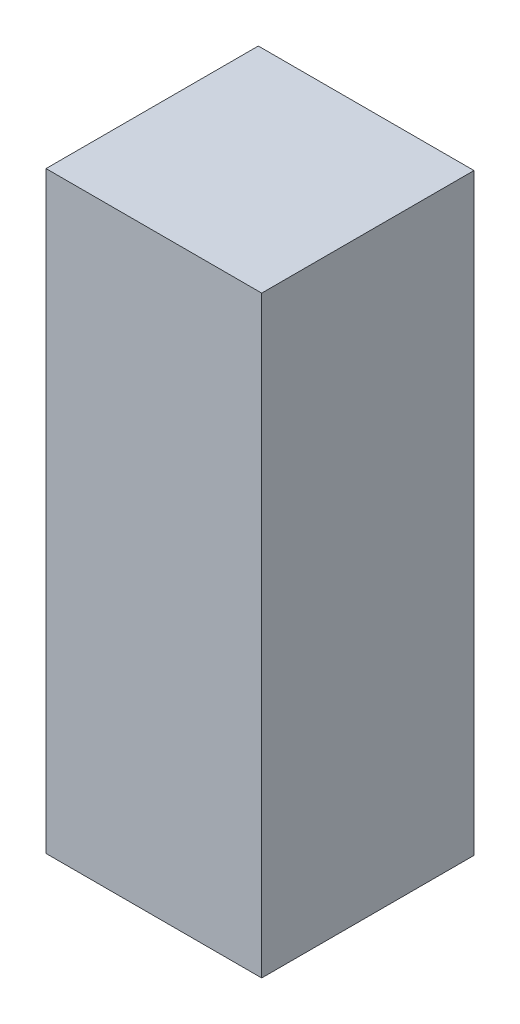
ISO-10303-21;
HEADER;
FILE_DESCRIPTION(('STEP AP214'),'2;1');
FILE_NAME('part.step','',(''),(''),'','','');
FILE_SCHEMA(('AUTOMOTIVE_DESIGN { 1 0 10303 214 1 1 1 1 }'));
ENDSEC;
DATA;
#1=APPLICATION_CONTEXT('core data for automotive mechanical design processes');
#2=APPLICATION_PROTOCOL_DEFINITION('international standard','automotive_design',2000,#1);
#3=PRODUCT_CONTEXT('',#1,'mechanical');
#4=PRODUCT('Part','Part','',(#3));
#5=PRODUCT_RELATED_PRODUCT_CATEGORY('part','',(#4));
#6=PRODUCT_DEFINITION_FORMATION('','',#4);
#7=PRODUCT_DEFINITION_CONTEXT('part definition',#1,'design');
#8=PRODUCT_DEFINITION('design','',#6,#7);
#9=PRODUCT_DEFINITION_SHAPE('','',#8);
#10=(LENGTH_UNIT() NAMED_UNIT(*) SI_UNIT(.MILLI.,.METRE.));
#11=(NAMED_UNIT(*) PLANE_ANGLE_UNIT() SI_UNIT($,.RADIAN.));
#12=(NAMED_UNIT(*) SI_UNIT($,.STERADIAN.) SOLID_ANGLE_UNIT());
#13=UNCERTAINTY_MEASURE_WITH_UNIT(LENGTH_MEASURE(1.E-05),#10,'distance_accuracy_value','');
#14=(GEOMETRIC_REPRESENTATION_CONTEXT(3) GLOBAL_UNCERTAINTY_ASSIGNED_CONTEXT((#13)) GLOBAL_UNIT_ASSIGNED_CONTEXT((#10,
#11,#12)) REPRESENTATION_CONTEXT('',''));
#15=CARTESIAN_POINT('',(0.,0.,0.));
#16=DIRECTION('',(0.,0.,1.));
#17=DIRECTION('',(1.,0.,0.));
#18=AXIS2_PLACEMENT_3D('',#15,#16,#17);
#19=CARTESIAN_POINT('',(0.,0.,0.1999996));
#20=DIRECTION('',(0.,0.,1.));
#21=DIRECTION('',(1.,0.,0.));
#22=AXIS2_PLACEMENT_3D('',#19,#20,#21);
#23=PLANE('',#22);
#24=DIRECTION('',(0.,1.,0.));
#25=VECTOR('',#24,1.);
#26=CARTESIAN_POINT('',(0.1016,-0.2794,0.1999996));
#27=LINE('',#26,#25);
#28=CARTESIAN_POINT('',(0.1016,-0.2794,0.1999996));
#29=VERTEX_POINT('',#28);
#30=CARTESIAN_POINT('',(0.1016,0.2794,0.1999996));
#31=VERTEX_POINT('',#30);
#32=EDGE_CURVE('E70',#29,#31,#27,.T.);
#33=ORIENTED_EDGE('',*,*,#32,.T.);
#34=DIRECTION('',(-1.,0.,0.));
#35=VECTOR('',#34,1.);
#36=CARTESIAN_POINT('',(0.1016,0.2794,0.1999996));
#37=LINE('',#36,#35);
#38=CARTESIAN_POINT('',(-0.1016,0.2794,0.1999996));
#39=VERTEX_POINT('',#38);
#40=EDGE_CURVE('E100',#31,#39,#37,.T.);
#41=ORIENTED_EDGE('',*,*,#40,.T.);
#42=DIRECTION('',(0.,-1.,0.));
#43=VECTOR('',#42,1.);
#44=CARTESIAN_POINT('',(-0.1016,0.2794,0.1999996));
#45=LINE('',#44,#43);
#46=CARTESIAN_POINT('',(-0.1016,-0.2794,0.1999996));
#47=VERTEX_POINT('',#46);
#48=EDGE_CURVE('E72',#39,#47,#45,.T.);
#49=ORIENTED_EDGE('',*,*,#48,.T.);
#50=DIRECTION('',(1.,0.,0.));
#51=VECTOR('',#50,1.);
#52=CARTESIAN_POINT('',(-0.1016,-0.2794,0.1999996));
#53=LINE('',#52,#51);
#54=EDGE_CURVE('E11',#47,#29,#53,.T.);
#55=ORIENTED_EDGE('',*,*,#54,.T.);
#56=EDGE_LOOP('',(#33,#41,#49,#55));
#57=FACE_BOUND('',#56,.T.);
#58=ADVANCED_FACE('F17',(#57),#23,.T.);
#59=CARTESIAN_POINT('',(0.,0.,0.));
#60=DIRECTION('',(0.,0.,1.));
#61=DIRECTION('',(1.,0.,0.));
#62=AXIS2_PLACEMENT_3D('',#59,#60,#61);
#63=PLANE('',#62);
#64=DIRECTION('',(1.,0.,0.));
#65=VECTOR('',#64,1.);
#66=CARTESIAN_POINT('',(-0.1016,-0.2794,0.));
#67=LINE('',#66,#65);
#68=CARTESIAN_POINT('',(-0.1016,-0.2794,0.));
#69=VERTEX_POINT('',#68);
#70=CARTESIAN_POINT('',(0.1016,-0.2794,0.));
#71=VERTEX_POINT('',#70);
#72=EDGE_CURVE('E25',#69,#71,#67,.T.);
#73=ORIENTED_EDGE('',*,*,#72,.F.);
#74=DIRECTION('',(0.,-1.,0.));
#75=VECTOR('',#74,1.);
#76=CARTESIAN_POINT('',(-0.1016,0.2794,0.));
#77=LINE('',#76,#75);
#78=CARTESIAN_POINT('',(-0.1016,0.2794,0.));
#79=VERTEX_POINT('',#78);
#80=EDGE_CURVE('E96',#79,#69,#77,.T.);
#81=ORIENTED_EDGE('',*,*,#80,.F.);
#82=DIRECTION('',(-1.,0.,0.));
#83=VECTOR('',#82,1.);
#84=CARTESIAN_POINT('',(0.1016,0.2794,0.));
#85=LINE('',#84,#83);
#86=CARTESIAN_POINT('',(0.1016,0.2794,0.));
#87=VERTEX_POINT('',#86);
#88=EDGE_CURVE('E80',#87,#79,#85,.T.);
#89=ORIENTED_EDGE('',*,*,#88,.F.);
#90=DIRECTION('',(0.,1.,0.));
#91=VECTOR('',#90,1.);
#92=CARTESIAN_POINT('',(0.1016,-0.2794,0.));
#93=LINE('',#92,#91);
#94=EDGE_CURVE('E89',#71,#87,#93,.T.);
#95=ORIENTED_EDGE('',*,*,#94,.F.);
#96=EDGE_LOOP('',(#73,#81,#89,#95));
#97=FACE_BOUND('',#96,.T.);
#98=ADVANCED_FACE('F124',(#97),#63,.F.);
#99=CARTESIAN_POINT('',(-0.1016,-0.2794,0.));
#100=DIRECTION('',(0.,1.,0.));
#101=DIRECTION('',(1.,0.,0.));
#102=AXIS2_PLACEMENT_3D('',#99,#100,#101);
#103=PLANE('',#102);
#104=ORIENTED_EDGE('',*,*,#72,.T.);
#105=DIRECTION('',(0.,0.,1.));
#106=VECTOR('',#105,1.);
#107=CARTESIAN_POINT('',(0.1016,-0.2794,0.));
#108=LINE('',#107,#106);
#109=EDGE_CURVE('E75',#71,#29,#108,.T.);
#110=ORIENTED_EDGE('',*,*,#109,.T.);
#111=ORIENTED_EDGE('',*,*,#54,.F.);
#112=DIRECTION('',(0.,0.,1.));
#113=VECTOR('',#112,1.);
#114=CARTESIAN_POINT('',(-0.1016,-0.2794,0.));
#115=LINE('',#114,#113);
#116=EDGE_CURVE('E93',#69,#47,#115,.T.);
#117=ORIENTED_EDGE('',*,*,#116,.F.);
#118=EDGE_LOOP('',(#104,#110,#111,#117));
#119=FACE_BOUND('',#118,.T.);
#120=ADVANCED_FACE('F76',(#119),#103,.F.);
#121=CARTESIAN_POINT('',(-0.1016,0.2794,0.));
#122=DIRECTION('',(1.,0.,0.));
#123=DIRECTION('',(0.,1.,0.));
#124=AXIS2_PLACEMENT_3D('',#121,#122,#123);
#125=PLANE('',#124);
#126=ORIENTED_EDGE('',*,*,#80,.T.);
#127=ORIENTED_EDGE('',*,*,#116,.T.);
#128=ORIENTED_EDGE('',*,*,#48,.F.);
#129=DIRECTION('',(0.,0.,1.));
#130=VECTOR('',#129,1.);
#131=CARTESIAN_POINT('',(-0.1016,0.2794,0.));
#132=LINE('',#131,#130);
#133=EDGE_CURVE('E99',#79,#39,#132,.T.);
#134=ORIENTED_EDGE('',*,*,#133,.F.);
#135=EDGE_LOOP('',(#126,#127,#128,#134));
#136=FACE_BOUND('',#135,.T.);
#137=ADVANCED_FACE('F127',(#136),#125,.F.);
#138=CARTESIAN_POINT('',(0.1016,0.2794,0.));
#139=DIRECTION('',(0.,-1.,0.));
#140=DIRECTION('',(0.,0.,-1.));
#141=AXIS2_PLACEMENT_3D('',#138,#139,#140);
#142=PLANE('',#141);
#143=ORIENTED_EDGE('',*,*,#88,.T.);
#144=ORIENTED_EDGE('',*,*,#133,.T.);
#145=ORIENTED_EDGE('',*,*,#40,.F.);
#146=DIRECTION('',(0.,0.,1.));
#147=VECTOR('',#146,1.);
#148=CARTESIAN_POINT('',(0.1016,0.2794,0.));
#149=LINE('',#148,#147);
#150=EDGE_CURVE('E84',#87,#31,#149,.T.);
#151=ORIENTED_EDGE('',*,*,#150,.F.);
#152=EDGE_LOOP('',(#143,#144,#145,#151));
#153=FACE_BOUND('',#152,.T.);
#154=ADVANCED_FACE('F125',(#153),#142,.F.);
#155=CARTESIAN_POINT('',(0.1016,-0.2794,0.));
#156=DIRECTION('',(-1.,0.,0.));
#157=DIRECTION('',(0.,0.,1.));
#158=AXIS2_PLACEMENT_3D('',#155,#156,#157);
#159=PLANE('',#158);
#160=ORIENTED_EDGE('',*,*,#94,.T.);
#161=ORIENTED_EDGE('',*,*,#150,.T.);
#162=ORIENTED_EDGE('',*,*,#32,.F.);
#163=ORIENTED_EDGE('',*,*,#109,.F.);
#164=EDGE_LOOP('',(#160,#161,#162,#163));
#165=FACE_BOUND('',#164,.T.);
#166=ADVANCED_FACE('F82',(#165),#159,.F.);
#167=CLOSED_SHELL('',(#58,#98,#120,#137,#154,#166));
#168=MANIFOLD_SOLID_BREP('B1',#167);
#169=ADVANCED_BREP_SHAPE_REPRESENTATION('',(#18,#168),#14);
#170=SHAPE_DEFINITION_REPRESENTATION(#9,#169);
ENDSEC;
END-ISO-10303-21;
